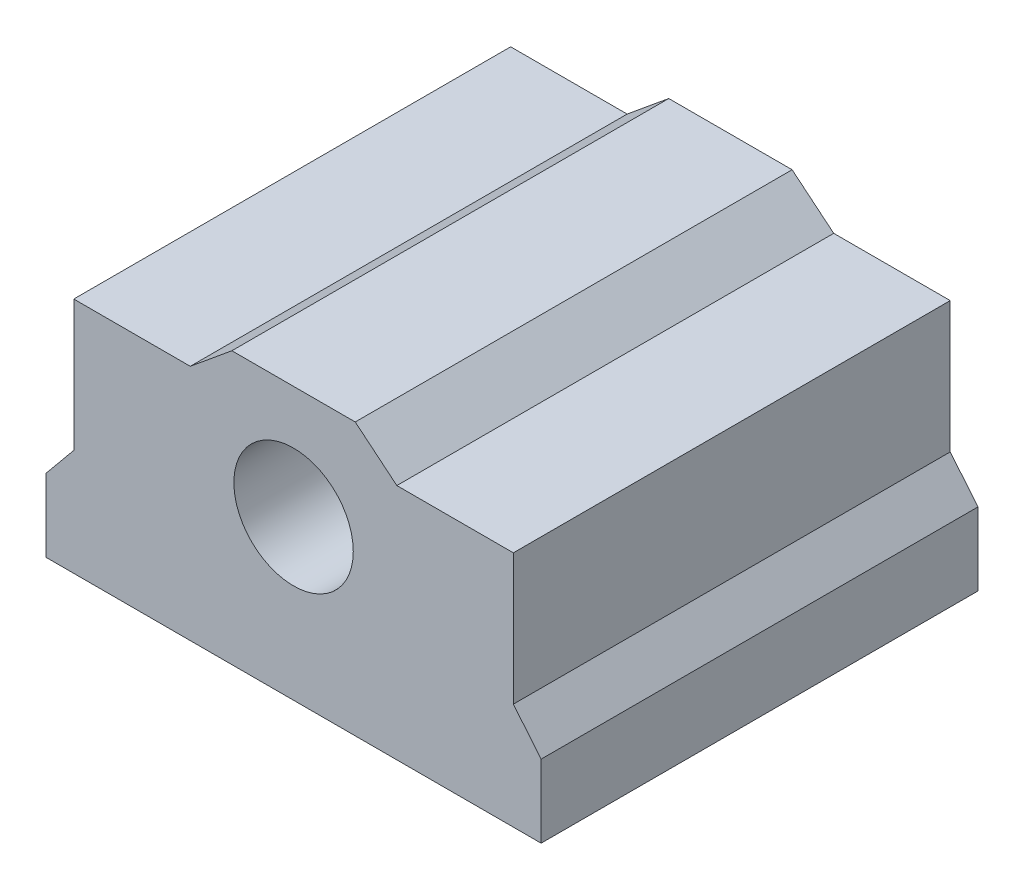
ISO-10303-21;
HEADER;
FILE_DESCRIPTION(('STEP AP214'),'2;1');
FILE_NAME('part.step','',(''),(''),'','','');
FILE_SCHEMA(('AUTOMOTIVE_DESIGN { 1 0 10303 214 1 1 1 1 }'));
ENDSEC;
DATA;
#1=APPLICATION_CONTEXT('core data for automotive mechanical design processes');
#2=APPLICATION_PROTOCOL_DEFINITION('international standard','automotive_design',2000,#1);
#3=PRODUCT_CONTEXT('',#1,'mechanical');
#4=PRODUCT('Part','Part','',(#3));
#5=PRODUCT_RELATED_PRODUCT_CATEGORY('part','',(#4));
#6=PRODUCT_DEFINITION_FORMATION('','',#4);
#7=PRODUCT_DEFINITION_CONTEXT('part definition',#1,'design');
#8=PRODUCT_DEFINITION('design','',#6,#7);
#9=PRODUCT_DEFINITION_SHAPE('','',#8);
#10=(LENGTH_UNIT() NAMED_UNIT(*) SI_UNIT(.MILLI.,.METRE.));
#11=(NAMED_UNIT(*) PLANE_ANGLE_UNIT() SI_UNIT($,.RADIAN.));
#12=(NAMED_UNIT(*) SI_UNIT($,.STERADIAN.) SOLID_ANGLE_UNIT());
#13=UNCERTAINTY_MEASURE_WITH_UNIT(LENGTH_MEASURE(1.E-05),#10,'distance_accuracy_value','');
#14=(GEOMETRIC_REPRESENTATION_CONTEXT(3) GLOBAL_UNCERTAINTY_ASSIGNED_CONTEXT((#13)) GLOBAL_UNIT_ASSIGNED_CONTEXT((#10,
#11,#12)) REPRESENTATION_CONTEXT('',''));
#15=CARTESIAN_POINT('',(0.,0.,0.));
#16=DIRECTION('',(0.,0.,1.));
#17=DIRECTION('',(1.,0.,0.));
#18=AXIS2_PLACEMENT_3D('',#15,#16,#17);
#19=CARTESIAN_POINT('',(0.,0.,30.));
#20=DIRECTION('',(0.,0.,-1.));
#21=DIRECTION('',(-1.,0.,0.));
#22=AXIS2_PLACEMENT_3D('',#19,#20,#21);
#23=PLANE('',#22);
#24=DIRECTION('',(0.,-1.,0.));
#25=VECTOR('',#24,1.);
#26=CARTESIAN_POINT('',(-17.,0.,30.));
#27=LINE('',#26,#25);
#28=CARTESIAN_POINT('',(-17.,5.,30.));
#29=VERTEX_POINT('',#28);
#30=CARTESIAN_POINT('',(-17.,0.,30.));
#31=VERTEX_POINT('',#30);
#32=EDGE_CURVE('E177',#29,#31,#27,.T.);
#33=ORIENTED_EDGE('',*,*,#32,.T.);
#34=DIRECTION('',(1.,0.,0.));
#35=VECTOR('',#34,1.);
#36=CARTESIAN_POINT('',(-17.,0.,30.));
#37=LINE('',#36,#35);
#38=CARTESIAN_POINT('',(17.,0.,30.));
#39=VERTEX_POINT('',#38);
#40=EDGE_CURVE('E105',#31,#39,#37,.T.);
#41=ORIENTED_EDGE('',*,*,#40,.T.);
#42=DIRECTION('',(0.,1.,0.));
#43=VECTOR('',#42,1.);
#44=CARTESIAN_POINT('',(17.,5.00000000000001,30.));
#45=LINE('',#44,#43);
#46=CARTESIAN_POINT('',(17.,5.00000000000001,30.));
#47=VERTEX_POINT('',#46);
#48=EDGE_CURVE('E204',#39,#47,#45,.T.);
#49=ORIENTED_EDGE('',*,*,#48,.T.);
#50=DIRECTION('',(-0.635759901042358,0.771886875278114,0.));
#51=VECTOR('',#50,1.);
#52=CARTESIAN_POINT('',(15.0927202968729,7.31566062583435,30.));
#53=LINE('',#52,#51);
#54=CARTESIAN_POINT('',(15.0927202968729,7.31566062583435,30.));
#55=VERTEX_POINT('',#54);
#56=EDGE_CURVE('E223',#47,#55,#53,.T.);
#57=ORIENTED_EDGE('',*,*,#56,.T.);
#58=DIRECTION('',(0.,1.,0.));
#59=VECTOR('',#58,1.);
#60=CARTESIAN_POINT('',(15.0927202968729,16.3156606258343,30.));
#61=LINE('',#60,#59);
#62=CARTESIAN_POINT('',(15.0927202968729,16.3156606258343,30.));
#63=VERTEX_POINT('',#62);
#64=EDGE_CURVE('E220',#55,#63,#61,.T.);
#65=ORIENTED_EDGE('',*,*,#64,.T.);
#66=DIRECTION('',(-1.,0.,0.));
#67=VECTOR('',#66,1.);
#68=CARTESIAN_POINT('',(7.09272029687293,16.3156606258343,30.));
#69=LINE('',#68,#67);
#70=CARTESIAN_POINT('',(7.09272029687293,16.3156606258343,30.));
#71=VERTEX_POINT('',#70);
#72=EDGE_CURVE('E222',#63,#71,#69,.T.);
#73=ORIENTED_EDGE('',*,*,#72,.T.);
#74=DIRECTION('',(-0.771886875278115,0.635759901042357,0.));
#75=VECTOR('',#74,1.);
#76=CARTESIAN_POINT('',(4.23585697337468,18.668698618849,30.));
#77=LINE('',#76,#75);
#78=CARTESIAN_POINT('',(4.23585697337468,18.668698618849,30.));
#79=VERTEX_POINT('',#78);
#80=EDGE_CURVE('E225',#71,#79,#77,.T.);
#81=ORIENTED_EDGE('',*,*,#80,.T.);
#82=DIRECTION('',(-1.,0.,0.));
#83=VECTOR('',#82,1.);
#84=CARTESIAN_POINT('',(-4.23585697337468,18.668698618849,30.));
#85=LINE('',#84,#83);
#86=CARTESIAN_POINT('',(-4.23585697337468,18.668698618849,30.));
#87=VERTEX_POINT('',#86);
#88=EDGE_CURVE('E231',#79,#87,#85,.T.);
#89=ORIENTED_EDGE('',*,*,#88,.T.);
#90=DIRECTION('',(-0.771886875278115,-0.635759901042357,0.));
#91=VECTOR('',#90,1.);
#92=CARTESIAN_POINT('',(-7.09272029687293,16.3156606258343,30.));
#93=LINE('',#92,#91);
#94=CARTESIAN_POINT('',(-7.09272029687293,16.3156606258343,30.));
#95=VERTEX_POINT('',#94);
#96=EDGE_CURVE('E136',#87,#95,#93,.T.);
#97=ORIENTED_EDGE('',*,*,#96,.T.);
#98=DIRECTION('',(-1.,0.,0.));
#99=VECTOR('',#98,1.);
#100=CARTESIAN_POINT('',(-15.0927202968729,16.3156606258343,30.));
#101=LINE('',#100,#99);
#102=CARTESIAN_POINT('',(-15.0927202968729,16.3156606258343,30.));
#103=VERTEX_POINT('',#102);
#104=EDGE_CURVE('E130',#95,#103,#101,.T.);
#105=ORIENTED_EDGE('',*,*,#104,.T.);
#106=DIRECTION('',(0.,-1.,0.));
#107=VECTOR('',#106,1.);
#108=CARTESIAN_POINT('',(-15.0927202968729,7.31566062583435,30.));
#109=LINE('',#108,#107);
#110=CARTESIAN_POINT('',(-15.0927202968729,7.31566062583435,30.));
#111=VERTEX_POINT('',#110);
#112=EDGE_CURVE('E134',#103,#111,#109,.T.);
#113=ORIENTED_EDGE('',*,*,#112,.T.);
#114=DIRECTION('',(-0.635759901042357,-0.771886875278115,0.));
#115=VECTOR('',#114,1.);
#116=CARTESIAN_POINT('',(-17.,5.,30.));
#117=LINE('',#116,#115);
#118=EDGE_CURVE('E50',#111,#29,#117,.T.);
#119=ORIENTED_EDGE('',*,*,#118,.T.);
#120=EDGE_LOOP('',(#33,#41,#49,#57,#65,#73,#81,#89,#97,#105,#113,#119));
#121=FACE_BOUND('',#120,.T.);
#122=CARTESIAN_POINT('',(0.,10.9,30.));
#123=DIRECTION('',(0.,0.,1.));
#124=DIRECTION('',(1.,0.,0.));
#125=AXIS2_PLACEMENT_3D('',#122,#123,#124);
#126=CIRCLE('',#125,4.1);
#127=CARTESIAN_POINT('',(4.1,10.9,30.));
#128=VERTEX_POINT('',#127);
#129=EDGE_CURVE('E158',#128,#128,#126,.T.);
#130=ORIENTED_EDGE('',*,*,#129,.F.);
#131=EDGE_LOOP('',(#130));
#132=FACE_BOUND('',#131,.T.);
#133=ADVANCED_FACE('F33',(#121,#132),#23,.F.);
#134=CARTESIAN_POINT('',(0.,0.,0.));
#135=DIRECTION('',(0.,0.,-1.));
#136=DIRECTION('',(-1.,0.,0.));
#137=AXIS2_PLACEMENT_3D('',#134,#135,#136);
#138=PLANE('',#137);
#139=DIRECTION('',(0.,-1.,0.));
#140=VECTOR('',#139,1.);
#141=CARTESIAN_POINT('',(-17.,0.,0.));
#142=LINE('',#141,#140);
#143=CARTESIAN_POINT('',(-17.,5.,0.));
#144=VERTEX_POINT('',#143);
#145=CARTESIAN_POINT('',(-17.,0.,0.));
#146=VERTEX_POINT('',#145);
#147=EDGE_CURVE('E154',#144,#146,#142,.T.);
#148=ORIENTED_EDGE('',*,*,#147,.F.);
#149=DIRECTION('',(-0.635759901042357,-0.771886875278115,0.));
#150=VECTOR('',#149,1.);
#151=CARTESIAN_POINT('',(-17.,5.,0.));
#152=LINE('',#151,#150);
#153=CARTESIAN_POINT('',(-15.0927202968729,7.31566062583435,0.));
#154=VERTEX_POINT('',#153);
#155=EDGE_CURVE('E97',#154,#144,#152,.T.);
#156=ORIENTED_EDGE('',*,*,#155,.F.);
#157=DIRECTION('',(0.,-1.,0.));
#158=VECTOR('',#157,1.);
#159=CARTESIAN_POINT('',(-15.0927202968729,7.31566062583435,0.));
#160=LINE('',#159,#158);
#161=CARTESIAN_POINT('',(-15.0927202968729,16.3156606258343,0.));
#162=VERTEX_POINT('',#161);
#163=EDGE_CURVE('E91',#162,#154,#160,.T.);
#164=ORIENTED_EDGE('',*,*,#163,.F.);
#165=DIRECTION('',(-1.,0.,0.));
#166=VECTOR('',#165,1.);
#167=CARTESIAN_POINT('',(-15.0927202968729,16.3156606258343,0.));
#168=LINE('',#167,#166);
#169=CARTESIAN_POINT('',(-7.09272029687293,16.3156606258343,0.));
#170=VERTEX_POINT('',#169);
#171=EDGE_CURVE('E144',#170,#162,#168,.T.);
#172=ORIENTED_EDGE('',*,*,#171,.F.);
#173=DIRECTION('',(-0.771886875278115,-0.635759901042357,0.));
#174=VECTOR('',#173,1.);
#175=CARTESIAN_POINT('',(-7.09272029687293,16.3156606258343,0.));
#176=LINE('',#175,#174);
#177=CARTESIAN_POINT('',(-4.23585697337468,18.668698618849,0.));
#178=VERTEX_POINT('',#177);
#179=EDGE_CURVE('E172',#178,#170,#176,.T.);
#180=ORIENTED_EDGE('',*,*,#179,.F.);
#181=DIRECTION('',(-1.,0.,0.));
#182=VECTOR('',#181,1.);
#183=CARTESIAN_POINT('',(-4.23585697337468,18.668698618849,0.));
#184=LINE('',#183,#182);
#185=CARTESIAN_POINT('',(4.23585697337468,18.668698618849,0.));
#186=VERTEX_POINT('',#185);
#187=EDGE_CURVE('E170',#186,#178,#184,.T.);
#188=ORIENTED_EDGE('',*,*,#187,.F.);
#189=DIRECTION('',(-0.771886875278115,0.635759901042357,0.));
#190=VECTOR('',#189,1.);
#191=CARTESIAN_POINT('',(4.23585697337468,18.668698618849,0.));
#192=LINE('',#191,#190);
#193=CARTESIAN_POINT('',(7.09272029687293,16.3156606258343,0.));
#194=VERTEX_POINT('',#193);
#195=EDGE_CURVE('E168',#194,#186,#192,.T.);
#196=ORIENTED_EDGE('',*,*,#195,.F.);
#197=DIRECTION('',(-1.,0.,0.));
#198=VECTOR('',#197,1.);
#199=CARTESIAN_POINT('',(7.09272029687293,16.3156606258343,0.));
#200=LINE('',#199,#198);
#201=CARTESIAN_POINT('',(15.0927202968729,16.3156606258343,0.));
#202=VERTEX_POINT('',#201);
#203=EDGE_CURVE('E166',#202,#194,#200,.T.);
#204=ORIENTED_EDGE('',*,*,#203,.F.);
#205=DIRECTION('',(0.,1.,0.));
#206=VECTOR('',#205,1.);
#207=CARTESIAN_POINT('',(15.0927202968729,16.3156606258343,0.));
#208=LINE('',#207,#206);
#209=CARTESIAN_POINT('',(15.0927202968729,7.31566062583435,0.));
#210=VERTEX_POINT('',#209);
#211=EDGE_CURVE('E164',#210,#202,#208,.T.);
#212=ORIENTED_EDGE('',*,*,#211,.F.);
#213=DIRECTION('',(-0.635759901042358,0.771886875278114,0.));
#214=VECTOR('',#213,1.);
#215=CARTESIAN_POINT('',(15.0927202968729,7.31566062583435,0.));
#216=LINE('',#215,#214);
#217=CARTESIAN_POINT('',(17.,5.00000000000001,0.));
#218=VERTEX_POINT('',#217);
#219=EDGE_CURVE('E162',#218,#210,#216,.T.);
#220=ORIENTED_EDGE('',*,*,#219,.F.);
#221=DIRECTION('',(0.,1.,0.));
#222=VECTOR('',#221,1.);
#223=CARTESIAN_POINT('',(17.,5.00000000000001,0.));
#224=LINE('',#223,#222);
#225=CARTESIAN_POINT('',(17.,0.,0.));
#226=VERTEX_POINT('',#225);
#227=EDGE_CURVE('E160',#226,#218,#224,.T.);
#228=ORIENTED_EDGE('',*,*,#227,.F.);
#229=DIRECTION('',(1.,0.,0.));
#230=VECTOR('',#229,1.);
#231=CARTESIAN_POINT('',(-17.,0.,0.));
#232=LINE('',#231,#230);
#233=EDGE_CURVE('E157',#146,#226,#232,.T.);
#234=ORIENTED_EDGE('',*,*,#233,.F.);
#235=EDGE_LOOP('',(#148,#156,#164,#172,#180,#188,#196,#204,#212,#220,#228,#234));
#236=FACE_BOUND('',#235,.T.);
#237=CARTESIAN_POINT('',(0.,10.9,0.));
#238=DIRECTION('',(0.,0.,1.));
#239=DIRECTION('',(1.,0.,0.));
#240=AXIS2_PLACEMENT_3D('',#237,#238,#239);
#241=CIRCLE('',#240,4.1);
#242=CARTESIAN_POINT('',(4.1,10.9,0.));
#243=VERTEX_POINT('',#242);
#244=EDGE_CURVE('E378',#243,#243,#241,.T.);
#245=ORIENTED_EDGE('',*,*,#244,.T.);
#246=EDGE_LOOP('',(#245));
#247=FACE_BOUND('',#246,.T.);
#248=ADVANCED_FACE('F208',(#236,#247),#138,.T.);
#249=CARTESIAN_POINT('',(-17.,0.,30.));
#250=DIRECTION('',(1.,0.,0.));
#251=DIRECTION('',(0.,0.,-1.));
#252=AXIS2_PLACEMENT_3D('',#249,#250,#251);
#253=PLANE('',#252);
#254=ORIENTED_EDGE('',*,*,#147,.T.);
#255=DIRECTION('',(0.,0.,-1.));
#256=VECTOR('',#255,1.);
#257=CARTESIAN_POINT('',(-17.,0.,30.));
#258=LINE('',#257,#256);
#259=EDGE_CURVE('E11',#31,#146,#258,.T.);
#260=ORIENTED_EDGE('',*,*,#259,.F.);
#261=ORIENTED_EDGE('',*,*,#32,.F.);
#262=DIRECTION('',(0.,0.,-1.));
#263=VECTOR('',#262,1.);
#264=CARTESIAN_POINT('',(-17.,5.,30.));
#265=LINE('',#264,#263);
#266=EDGE_CURVE('E150',#29,#144,#265,.T.);
#267=ORIENTED_EDGE('',*,*,#266,.T.);
#268=EDGE_LOOP('',(#254,#260,#261,#267));
#269=FACE_BOUND('',#268,.T.);
#270=ADVANCED_FACE('F35',(#269),#253,.F.);
#271=CARTESIAN_POINT('',(-17.,0.,30.));
#272=DIRECTION('',(0.,1.,0.));
#273=DIRECTION('',(-1.,0.,0.));
#274=AXIS2_PLACEMENT_3D('',#271,#272,#273);
#275=PLANE('',#274);
#276=ORIENTED_EDGE('',*,*,#233,.T.);
#277=DIRECTION('',(0.,0.,-1.));
#278=VECTOR('',#277,1.);
#279=CARTESIAN_POINT('',(17.,0.,30.));
#280=LINE('',#279,#278);
#281=EDGE_CURVE('E42',#39,#226,#280,.T.);
#282=ORIENTED_EDGE('',*,*,#281,.F.);
#283=ORIENTED_EDGE('',*,*,#40,.F.);
#284=ORIENTED_EDGE('',*,*,#259,.T.);
#285=EDGE_LOOP('',(#276,#282,#283,#284));
#286=FACE_BOUND('',#285,.T.);
#287=ADVANCED_FACE('F265',(#286),#275,.F.);
#288=CARTESIAN_POINT('',(17.,5.00000000000001,30.));
#289=DIRECTION('',(-1.,0.,0.));
#290=DIRECTION('',(0.,0.,1.));
#291=AXIS2_PLACEMENT_3D('',#288,#289,#290);
#292=PLANE('',#291);
#293=ORIENTED_EDGE('',*,*,#227,.T.);
#294=DIRECTION('',(0.,0.,-1.));
#295=VECTOR('',#294,1.);
#296=CARTESIAN_POINT('',(17.,5.00000000000001,30.));
#297=LINE('',#296,#295);
#298=EDGE_CURVE('E196',#47,#218,#297,.T.);
#299=ORIENTED_EDGE('',*,*,#298,.F.);
#300=ORIENTED_EDGE('',*,*,#48,.F.);
#301=ORIENTED_EDGE('',*,*,#281,.T.);
#302=EDGE_LOOP('',(#293,#299,#300,#301));
#303=FACE_BOUND('',#302,.T.);
#304=ADVANCED_FACE('F202',(#303),#292,.F.);
#305=CARTESIAN_POINT('',(15.0927202968729,7.31566062583435,30.));
#306=DIRECTION('',(-0.771886875278114,-0.635759901042358,0.));
#307=DIRECTION('',(0.635759901042358,-0.771886875278114,0.));
#308=AXIS2_PLACEMENT_3D('',#305,#306,#307);
#309=PLANE('',#308);
#310=ORIENTED_EDGE('',*,*,#219,.T.);
#311=DIRECTION('',(0.,0.,-1.));
#312=VECTOR('',#311,1.);
#313=CARTESIAN_POINT('',(15.0927202968729,7.31566062583435,30.));
#314=LINE('',#313,#312);
#315=EDGE_CURVE('E193',#55,#210,#314,.T.);
#316=ORIENTED_EDGE('',*,*,#315,.F.);
#317=ORIENTED_EDGE('',*,*,#56,.F.);
#318=ORIENTED_EDGE('',*,*,#298,.T.);
#319=EDGE_LOOP('',(#310,#316,#317,#318));
#320=FACE_BOUND('',#319,.T.);
#321=ADVANCED_FACE('F214',(#320),#309,.F.);
#322=CARTESIAN_POINT('',(15.0927202968729,16.3156606258343,30.));
#323=DIRECTION('',(-1.,0.,0.));
#324=DIRECTION('',(0.,0.,1.));
#325=AXIS2_PLACEMENT_3D('',#322,#323,#324);
#326=PLANE('',#325);
#327=ORIENTED_EDGE('',*,*,#211,.T.);
#328=DIRECTION('',(0.,0.,-1.));
#329=VECTOR('',#328,1.);
#330=CARTESIAN_POINT('',(15.0927202968729,16.3156606258343,30.));
#331=LINE('',#330,#329);
#332=EDGE_CURVE('E190',#63,#202,#331,.T.);
#333=ORIENTED_EDGE('',*,*,#332,.F.);
#334=ORIENTED_EDGE('',*,*,#64,.F.);
#335=ORIENTED_EDGE('',*,*,#315,.T.);
#336=EDGE_LOOP('',(#327,#333,#334,#335));
#337=FACE_BOUND('',#336,.T.);
#338=ADVANCED_FACE('F218',(#337),#326,.F.);
#339=CARTESIAN_POINT('',(7.09272029687293,16.3156606258343,30.));
#340=DIRECTION('',(0.,-1.,0.));
#341=DIRECTION('',(0.,0.,-1.));
#342=AXIS2_PLACEMENT_3D('',#339,#340,#341);
#343=PLANE('',#342);
#344=ORIENTED_EDGE('',*,*,#203,.T.);
#345=DIRECTION('',(0.,0.,-1.));
#346=VECTOR('',#345,1.);
#347=CARTESIAN_POINT('',(7.09272029687293,16.3156606258343,30.));
#348=LINE('',#347,#346);
#349=EDGE_CURVE('E187',#71,#194,#348,.T.);
#350=ORIENTED_EDGE('',*,*,#349,.F.);
#351=ORIENTED_EDGE('',*,*,#72,.F.);
#352=ORIENTED_EDGE('',*,*,#332,.T.);
#353=EDGE_LOOP('',(#344,#350,#351,#352));
#354=FACE_BOUND('',#353,.T.);
#355=ADVANCED_FACE('F278',(#354),#343,.F.);
#356=CARTESIAN_POINT('',(4.23585697337468,18.668698618849,30.));
#357=DIRECTION('',(-0.635759901042357,-0.771886875278115,0.));
#358=DIRECTION('',(0.771886875278115,-0.635759901042357,0.));
#359=AXIS2_PLACEMENT_3D('',#356,#357,#358);
#360=PLANE('',#359);
#361=ORIENTED_EDGE('',*,*,#195,.T.);
#362=DIRECTION('',(0.,0.,-1.));
#363=VECTOR('',#362,1.);
#364=CARTESIAN_POINT('',(4.23585697337468,18.668698618849,30.));
#365=LINE('',#364,#363);
#366=EDGE_CURVE('E184',#79,#186,#365,.T.);
#367=ORIENTED_EDGE('',*,*,#366,.F.);
#368=ORIENTED_EDGE('',*,*,#80,.F.);
#369=ORIENTED_EDGE('',*,*,#349,.T.);
#370=EDGE_LOOP('',(#361,#367,#368,#369));
#371=FACE_BOUND('',#370,.T.);
#372=ADVANCED_FACE('F281',(#371),#360,.F.);
#373=CARTESIAN_POINT('',(-4.23585697337468,18.668698618849,30.));
#374=DIRECTION('',(0.,-1.,0.));
#375=DIRECTION('',(0.,0.,-1.));
#376=AXIS2_PLACEMENT_3D('',#373,#374,#375);
#377=PLANE('',#376);
#378=ORIENTED_EDGE('',*,*,#187,.T.);
#379=DIRECTION('',(0.,0.,-1.));
#380=VECTOR('',#379,1.);
#381=CARTESIAN_POINT('',(-4.23585697337468,18.668698618849,30.));
#382=LINE('',#381,#380);
#383=EDGE_CURVE('E181',#87,#178,#382,.T.);
#384=ORIENTED_EDGE('',*,*,#383,.F.);
#385=ORIENTED_EDGE('',*,*,#88,.F.);
#386=ORIENTED_EDGE('',*,*,#366,.T.);
#387=EDGE_LOOP('',(#378,#384,#385,#386));
#388=FACE_BOUND('',#387,.T.);
#389=ADVANCED_FACE('F237',(#388),#377,.F.);
#390=CARTESIAN_POINT('',(-7.09272029687293,16.3156606258343,30.));
#391=DIRECTION('',(0.635759901042357,-0.771886875278115,0.));
#392=DIRECTION('',(0.771886875278115,0.635759901042357,0.));
#393=AXIS2_PLACEMENT_3D('',#390,#391,#392);
#394=PLANE('',#393);
#395=ORIENTED_EDGE('',*,*,#179,.T.);
#396=DIRECTION('',(0.,0.,-1.));
#397=VECTOR('',#396,1.);
#398=CARTESIAN_POINT('',(-7.09272029687293,16.3156606258343,30.));
#399=LINE('',#398,#397);
#400=EDGE_CURVE('E145',#95,#170,#399,.T.);
#401=ORIENTED_EDGE('',*,*,#400,.F.);
#402=ORIENTED_EDGE('',*,*,#96,.F.);
#403=ORIENTED_EDGE('',*,*,#383,.T.);
#404=EDGE_LOOP('',(#395,#401,#402,#403));
#405=FACE_BOUND('',#404,.T.);
#406=ADVANCED_FACE('F241',(#405),#394,.F.);
#407=CARTESIAN_POINT('',(-15.0927202968729,16.3156606258343,30.));
#408=DIRECTION('',(0.,-1.,0.));
#409=DIRECTION('',(0.,0.,-1.));
#410=AXIS2_PLACEMENT_3D('',#407,#408,#409);
#411=PLANE('',#410);
#412=ORIENTED_EDGE('',*,*,#171,.T.);
#413=DIRECTION('',(0.,0.,-1.));
#414=VECTOR('',#413,1.);
#415=CARTESIAN_POINT('',(-15.0927202968729,16.3156606258343,30.));
#416=LINE('',#415,#414);
#417=EDGE_CURVE('E141',#103,#162,#416,.T.);
#418=ORIENTED_EDGE('',*,*,#417,.F.);
#419=ORIENTED_EDGE('',*,*,#104,.F.);
#420=ORIENTED_EDGE('',*,*,#400,.T.);
#421=EDGE_LOOP('',(#412,#418,#419,#420));
#422=FACE_BOUND('',#421,.T.);
#423=ADVANCED_FACE('F142',(#422),#411,.F.);
#424=CARTESIAN_POINT('',(-15.0927202968729,7.31566062583435,30.));
#425=DIRECTION('',(1.,0.,0.));
#426=DIRECTION('',(0.,0.,-1.));
#427=AXIS2_PLACEMENT_3D('',#424,#425,#426);
#428=PLANE('',#427);
#429=ORIENTED_EDGE('',*,*,#163,.T.);
#430=DIRECTION('',(0.,0.,-1.));
#431=VECTOR('',#430,1.);
#432=CARTESIAN_POINT('',(-15.0927202968729,7.31566062583435,30.));
#433=LINE('',#432,#431);
#434=EDGE_CURVE('E146',#111,#154,#433,.T.);
#435=ORIENTED_EDGE('',*,*,#434,.F.);
#436=ORIENTED_EDGE('',*,*,#112,.F.);
#437=ORIENTED_EDGE('',*,*,#417,.T.);
#438=EDGE_LOOP('',(#429,#435,#436,#437));
#439=FACE_BOUND('',#438,.T.);
#440=ADVANCED_FACE('F148',(#439),#428,.F.);
#441=CARTESIAN_POINT('',(-17.,5.,30.));
#442=DIRECTION('',(0.771886875278115,-0.635759901042357,0.));
#443=DIRECTION('',(0.635759901042357,0.771886875278115,0.));
#444=AXIS2_PLACEMENT_3D('',#441,#442,#443);
#445=PLANE('',#444);
#446=ORIENTED_EDGE('',*,*,#155,.T.);
#447=ORIENTED_EDGE('',*,*,#266,.F.);
#448=ORIENTED_EDGE('',*,*,#118,.F.);
#449=ORIENTED_EDGE('',*,*,#434,.T.);
#450=EDGE_LOOP('',(#446,#447,#448,#449));
#451=FACE_BOUND('',#450,.T.);
#452=ADVANCED_FACE('F245',(#451),#445,.F.);
#453=CARTESIAN_POINT('',(0.,10.9,30.));
#454=DIRECTION('',(0.,0.,-1.));
#455=DIRECTION('',(-1.,0.,0.));
#456=AXIS2_PLACEMENT_3D('',#453,#454,#455);
#457=CYLINDRICAL_SURFACE('',#456,4.1);
#458=ORIENTED_EDGE('',*,*,#129,.T.);
#459=EDGE_LOOP('',(#458));
#460=FACE_BOUND('',#459,.T.);
#461=ORIENTED_EDGE('',*,*,#244,.F.);
#462=EDGE_LOOP('',(#461));
#463=FACE_BOUND('',#462,.T.);
#464=ADVANCED_FACE('F247',(#460,#463),#457,.F.);
#465=CLOSED_SHELL('',(#133,#248,#270,#287,#304,#321,#338,#355,#372,#389,#406,#423,#440,#452,#464));
#466=MANIFOLD_SOLID_BREP('B2',#465);
#467=ADVANCED_BREP_SHAPE_REPRESENTATION('',(#18,#466),#14);
#468=SHAPE_DEFINITION_REPRESENTATION(#9,#467);
ENDSEC;
END-ISO-10303-21;
